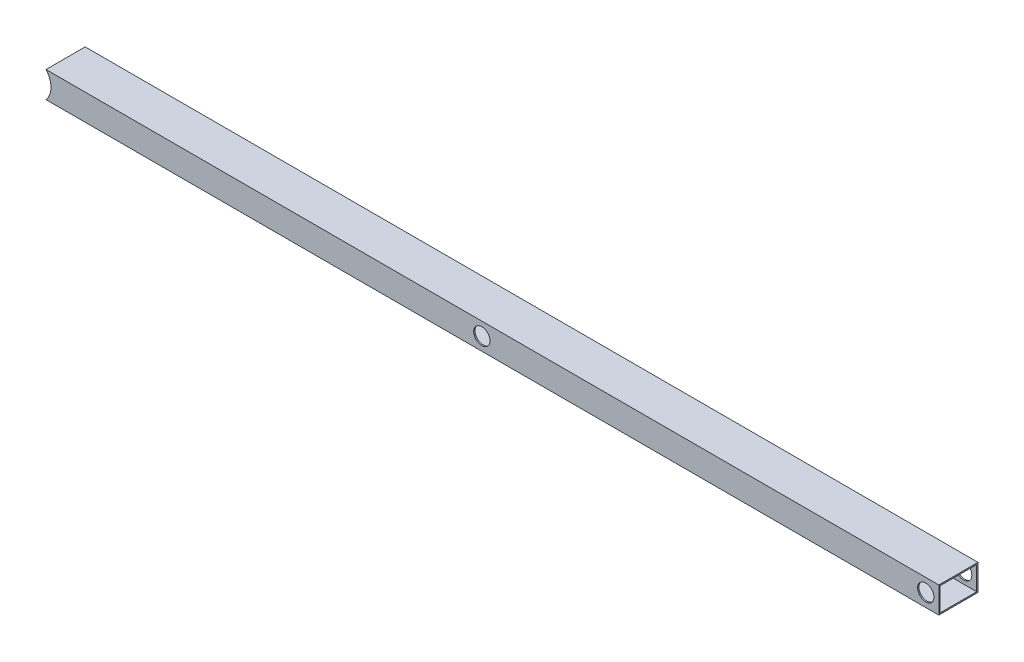
ISO-10303-21;
HEADER;
FILE_DESCRIPTION(('STEP AP214'),'2;1');
FILE_NAME('part.step','',(''),(''),'','','');
FILE_SCHEMA(('AUTOMOTIVE_DESIGN { 1 0 10303 214 1 1 1 1 }'));
ENDSEC;
DATA;
#1=APPLICATION_CONTEXT('core data for automotive mechanical design processes');
#2=APPLICATION_PROTOCOL_DEFINITION('international standard','automotive_design',2000,#1);
#3=PRODUCT_CONTEXT('',#1,'mechanical');
#4=PRODUCT('Part','Part','',(#3));
#5=PRODUCT_RELATED_PRODUCT_CATEGORY('part','',(#4));
#6=PRODUCT_DEFINITION_FORMATION('','',#4);
#7=PRODUCT_DEFINITION_CONTEXT('part definition',#1,'design');
#8=PRODUCT_DEFINITION('design','',#6,#7);
#9=PRODUCT_DEFINITION_SHAPE('','',#8);
#10=(LENGTH_UNIT() NAMED_UNIT(*) SI_UNIT(.MILLI.,.METRE.));
#11=(NAMED_UNIT(*) PLANE_ANGLE_UNIT() SI_UNIT($,.RADIAN.));
#12=(NAMED_UNIT(*) SI_UNIT($,.STERADIAN.) SOLID_ANGLE_UNIT());
#13=UNCERTAINTY_MEASURE_WITH_UNIT(LENGTH_MEASURE(1.E-05),#10,'distance_accuracy_value','');
#14=(GEOMETRIC_REPRESENTATION_CONTEXT(3) GLOBAL_UNCERTAINTY_ASSIGNED_CONTEXT((#13)) GLOBAL_UNIT_ASSIGNED_CONTEXT((#10,
#11,#12)) REPRESENTATION_CONTEXT('',''));
#15=CARTESIAN_POINT('',(0.,0.,0.));
#16=DIRECTION('',(0.,0.,1.));
#17=DIRECTION('',(1.,0.,0.));
#18=AXIS2_PLACEMENT_3D('',#15,#16,#17);
#19=CARTESIAN_POINT('',(680.,0.,30.));
#20=DIRECTION('',(0.,0.,-1.));
#21=DIRECTION('',(-1.,0.,0.));
#22=AXIS2_PLACEMENT_3D('',#19,#20,#21);
#23=CYLINDRICAL_SURFACE('',#22,12.5);
#24=CARTESIAN_POINT('',(680.,0.,28.));
#25=DIRECTION('',(0.,0.,1.));
#26=DIRECTION('',(1.,0.,0.));
#27=AXIS2_PLACEMENT_3D('',#24,#25,#26);
#28=CIRCLE('',#27,12.5);
#29=CARTESIAN_POINT('',(692.5,0.,28.));
#30=VERTEX_POINT('',#29);
#31=EDGE_CURVE('E155',#30,#30,#28,.T.);
#32=ORIENTED_EDGE('',*,*,#31,.F.);
#33=EDGE_LOOP('',(#32));
#34=FACE_BOUND('',#33,.T.);
#35=CARTESIAN_POINT('',(680.,0.,30.));
#36=DIRECTION('',(0.,0.,1.));
#37=DIRECTION('',(1.,0.,0.));
#38=AXIS2_PLACEMENT_3D('',#35,#36,#37);
#39=CIRCLE('',#38,12.5);
#40=CARTESIAN_POINT('',(692.5,0.,30.));
#41=VERTEX_POINT('',#40);
#42=EDGE_CURVE('E168',#41,#41,#39,.T.);
#43=ORIENTED_EDGE('',*,*,#42,.T.);
#44=EDGE_LOOP('',(#43));
#45=FACE_BOUND('',#44,.T.);
#46=ADVANCED_FACE('F44',(#34,#45),#23,.F.);
#47=CARTESIAN_POINT('',(0.,0.,30.));
#48=DIRECTION('',(0.,0.,-1.));
#49=DIRECTION('',(-1.,0.,0.));
#50=AXIS2_PLACEMENT_3D('',#47,#48,#49);
#51=CYLINDRICAL_SURFACE('',#50,12.5);
#52=CARTESIAN_POINT('',(0.,0.,28.));
#53=DIRECTION('',(0.,0.,1.));
#54=DIRECTION('',(1.,0.,0.));
#55=AXIS2_PLACEMENT_3D('',#52,#53,#54);
#56=CIRCLE('',#55,12.5);
#57=CARTESIAN_POINT('',(12.5,0.,28.));
#58=VERTEX_POINT('',#57);
#59=EDGE_CURVE('E48',#58,#58,#56,.T.);
#60=ORIENTED_EDGE('',*,*,#59,.F.);
#61=EDGE_LOOP('',(#60));
#62=FACE_BOUND('',#61,.T.);
#63=CARTESIAN_POINT('',(0.,0.,30.));
#64=DIRECTION('',(0.,0.,1.));
#65=DIRECTION('',(1.,0.,0.));
#66=AXIS2_PLACEMENT_3D('',#63,#64,#65);
#67=CIRCLE('',#66,12.5);
#68=CARTESIAN_POINT('',(12.5,0.,30.));
#69=VERTEX_POINT('',#68);
#70=EDGE_CURVE('E188',#69,#69,#67,.T.);
#71=ORIENTED_EDGE('',*,*,#70,.T.);
#72=EDGE_LOOP('',(#71));
#73=FACE_BOUND('',#72,.T.);
#74=ADVANCED_FACE('F231',(#62,#73),#51,.F.);
#75=CARTESIAN_POINT('',(-690.,0.,30.));
#76=DIRECTION('',(0.,0.,-1.));
#77=DIRECTION('',(-1.,0.,0.));
#78=AXIS2_PLACEMENT_3D('',#75,#76,#77);
#79=CYLINDRICAL_SURFACE('',#78,30.);
#80=DIRECTION('',(0.,0.,-1.));
#81=VECTOR('',#80,1.);
#82=CARTESIAN_POINT('',(-666.,-18.,30.));
#83=LINE('',#82,#81);
#84=CARTESIAN_POINT('',(-666.,-18.,-28.));
#85=VERTEX_POINT('',#84);
#86=CARTESIAN_POINT('',(-666.,-18.,28.));
#87=VERTEX_POINT('',#86);
#88=EDGE_CURVE('E164',#85,#87,#83,.F.);
#89=ORIENTED_EDGE('',*,*,#88,.F.);
#90=CARTESIAN_POINT('',(-690.,0.,-28.));
#91=DIRECTION('',(0.,0.,-1.));
#92=DIRECTION('',(-1.,0.,0.));
#93=AXIS2_PLACEMENT_3D('',#90,#91,#92);
#94=CIRCLE('',#93,30.);
#95=CARTESIAN_POINT('',(-666.,18.,-28.));
#96=VERTEX_POINT('',#95);
#97=EDGE_CURVE('E152',#96,#85,#94,.T.);
#98=ORIENTED_EDGE('',*,*,#97,.F.);
#99=DIRECTION('',(0.,0.,-1.));
#100=VECTOR('',#99,1.);
#101=CARTESIAN_POINT('',(-666.,18.,30.));
#102=LINE('',#101,#100);
#103=CARTESIAN_POINT('',(-666.,18.,28.));
#104=VERTEX_POINT('',#103);
#105=EDGE_CURVE('E117',#104,#96,#102,.T.);
#106=ORIENTED_EDGE('',*,*,#105,.F.);
#107=CARTESIAN_POINT('',(-690.,0.,28.));
#108=DIRECTION('',(0.,0.,1.));
#109=DIRECTION('',(1.,0.,0.));
#110=AXIS2_PLACEMENT_3D('',#107,#108,#109);
#111=CIRCLE('',#110,30.);
#112=EDGE_CURVE('E159',#87,#104,#111,.T.);
#113=ORIENTED_EDGE('',*,*,#112,.F.);
#114=EDGE_LOOP('',(#89,#98,#106,#113));
#115=FACE_BOUND('',#114,.T.);
#116=CARTESIAN_POINT('',(-690.,0.,-30.));
#117=DIRECTION('',(0.,0.,1.));
#118=DIRECTION('',(1.,0.,0.));
#119=AXIS2_PLACEMENT_3D('',#116,#117,#118);
#120=CIRCLE('',#119,30.);
#121=CARTESIAN_POINT('',(-667.639320225002,-19.9999999999998,-30.));
#122=VERTEX_POINT('',#121);
#123=CARTESIAN_POINT('',(-667.639320225002,19.9999999999999,-30.));
#124=VERTEX_POINT('',#123);
#125=EDGE_CURVE('E196',#122,#124,#120,.T.);
#126=ORIENTED_EDGE('',*,*,#125,.F.);
#127=DIRECTION('',(0.,0.,-1.));
#128=VECTOR('',#127,1.);
#129=CARTESIAN_POINT('',(-667.639320225002,-19.9999999999998,30.));
#130=LINE('',#129,#128);
#131=CARTESIAN_POINT('',(-667.639320225002,-19.9999999999998,30.));
#132=VERTEX_POINT('',#131);
#133=EDGE_CURVE('E11',#132,#122,#130,.T.);
#134=ORIENTED_EDGE('',*,*,#133,.F.);
#135=CARTESIAN_POINT('',(-690.,0.,30.));
#136=DIRECTION('',(0.,0.,1.));
#137=DIRECTION('',(1.,0.,0.));
#138=AXIS2_PLACEMENT_3D('',#135,#136,#137);
#139=CIRCLE('',#138,30.);
#140=CARTESIAN_POINT('',(-667.639320225002,19.9999999999999,30.));
#141=VERTEX_POINT('',#140);
#142=EDGE_CURVE('E172',#132,#141,#139,.T.);
#143=ORIENTED_EDGE('',*,*,#142,.T.);
#144=DIRECTION('',(0.,0.,-1.));
#145=VECTOR('',#144,1.);
#146=CARTESIAN_POINT('',(-667.639320225002,19.9999999999999,30.));
#147=LINE('',#146,#145);
#148=EDGE_CURVE('E192',#141,#124,#147,.T.);
#149=ORIENTED_EDGE('',*,*,#148,.T.);
#150=EDGE_LOOP('',(#126,#134,#143,#149));
#151=FACE_BOUND('',#150,.T.);
#152=ADVANCED_FACE('F254',(#115,#151),#79,.F.);
#153=CARTESIAN_POINT('',(0.,-19.9999999999999,30.));
#154=DIRECTION('',(0.,-1.,0.));
#155=DIRECTION('',(1.,0.,0.));
#156=AXIS2_PLACEMENT_3D('',#153,#154,#155);
#157=PLANE('',#156);
#158=DIRECTION('',(-1.,0.,0.));
#159=VECTOR('',#158,1.);
#160=CARTESIAN_POINT('',(0.,-19.9999999999999,-30.));
#161=LINE('',#160,#159);
#162=CARTESIAN_POINT('',(700.,-20.,-30.));
#163=VERTEX_POINT('',#162);
#164=EDGE_CURVE('E200',#163,#122,#161,.T.);
#165=ORIENTED_EDGE('',*,*,#164,.F.);
#166=DIRECTION('',(0.,0.,-1.));
#167=VECTOR('',#166,1.);
#168=CARTESIAN_POINT('',(700.,-20.,30.));
#169=LINE('',#168,#167);
#170=CARTESIAN_POINT('',(700.,-20.,30.));
#171=VERTEX_POINT('',#170);
#172=EDGE_CURVE('E54',#171,#163,#169,.T.);
#173=ORIENTED_EDGE('',*,*,#172,.F.);
#174=DIRECTION('',(-1.,0.,0.));
#175=VECTOR('',#174,1.);
#176=CARTESIAN_POINT('',(0.,-19.9999999999999,30.));
#177=LINE('',#176,#175);
#178=EDGE_CURVE('E177',#171,#132,#177,.T.);
#179=ORIENTED_EDGE('',*,*,#178,.T.);
#180=ORIENTED_EDGE('',*,*,#133,.T.);
#181=EDGE_LOOP('',(#165,#173,#179,#180));
#182=FACE_BOUND('',#181,.T.);
#183=ADVANCED_FACE('F296',(#182),#157,.T.);
#184=CARTESIAN_POINT('',(700.,0.,30.));
#185=DIRECTION('',(1.,0.,0.));
#186=DIRECTION('',(0.,0.,-1.));
#187=AXIS2_PLACEMENT_3D('',#184,#185,#186);
#188=PLANE('',#187);
#189=DIRECTION('',(0.,0.,-1.));
#190=VECTOR('',#189,1.);
#191=CARTESIAN_POINT('',(700.,-18.,28.));
#192=LINE('',#191,#190);
#193=CARTESIAN_POINT('',(700.,-18.,28.));
#194=VERTEX_POINT('',#193);
#195=CARTESIAN_POINT('',(700.,-18.,-28.));
#196=VERTEX_POINT('',#195);
#197=EDGE_CURVE('E70',#194,#196,#192,.T.);
#198=ORIENTED_EDGE('',*,*,#197,.F.);
#199=DIRECTION('',(0.,-1.,0.));
#200=VECTOR('',#199,1.);
#201=CARTESIAN_POINT('',(700.,18.,28.));
#202=LINE('',#201,#200);
#203=CARTESIAN_POINT('',(700.,18.,28.));
#204=VERTEX_POINT('',#203);
#205=EDGE_CURVE('E133',#204,#194,#202,.T.);
#206=ORIENTED_EDGE('',*,*,#205,.F.);
#207=DIRECTION('',(0.,0.,1.));
#208=VECTOR('',#207,1.);
#209=CARTESIAN_POINT('',(700.,18.,-28.));
#210=LINE('',#209,#208);
#211=CARTESIAN_POINT('',(700.,18.,-28.));
#212=VERTEX_POINT('',#211);
#213=EDGE_CURVE('E114',#212,#204,#210,.T.);
#214=ORIENTED_EDGE('',*,*,#213,.F.);
#215=DIRECTION('',(0.,1.,0.));
#216=VECTOR('',#215,1.);
#217=CARTESIAN_POINT('',(700.,-18.,-28.));
#218=LINE('',#217,#216);
#219=EDGE_CURVE('E124',#196,#212,#218,.T.);
#220=ORIENTED_EDGE('',*,*,#219,.F.);
#221=EDGE_LOOP('',(#198,#206,#214,#220));
#222=FACE_BOUND('',#221,.T.);
#223=DIRECTION('',(0.,-1.,0.));
#224=VECTOR('',#223,1.);
#225=CARTESIAN_POINT('',(700.,0.,-30.));
#226=LINE('',#225,#224);
#227=CARTESIAN_POINT('',(700.,20.,-30.));
#228=VERTEX_POINT('',#227);
#229=EDGE_CURVE('E204',#228,#163,#226,.T.);
#230=ORIENTED_EDGE('',*,*,#229,.F.);
#231=DIRECTION('',(0.,0.,-1.));
#232=VECTOR('',#231,1.);
#233=CARTESIAN_POINT('',(700.,20.,30.));
#234=LINE('',#233,#232);
#235=CARTESIAN_POINT('',(700.,20.,30.));
#236=VERTEX_POINT('',#235);
#237=EDGE_CURVE('E217',#236,#228,#234,.T.);
#238=ORIENTED_EDGE('',*,*,#237,.F.);
#239=DIRECTION('',(0.,-1.,0.));
#240=VECTOR('',#239,1.);
#241=CARTESIAN_POINT('',(700.,0.,30.));
#242=LINE('',#241,#240);
#243=EDGE_CURVE('E181',#236,#171,#242,.T.);
#244=ORIENTED_EDGE('',*,*,#243,.T.);
#245=ORIENTED_EDGE('',*,*,#172,.T.);
#246=EDGE_LOOP('',(#230,#238,#244,#245));
#247=FACE_BOUND('',#246,.T.);
#248=ADVANCED_FACE('F130',(#222,#247),#188,.T.);
#249=CARTESIAN_POINT('',(0.,19.9999999999999,30.));
#250=DIRECTION('',(0.,-1.,0.));
#251=DIRECTION('',(1.,0.,0.));
#252=AXIS2_PLACEMENT_3D('',#249,#250,#251);
#253=PLANE('',#252);
#254=DIRECTION('',(-1.,0.,0.));
#255=VECTOR('',#254,1.);
#256=CARTESIAN_POINT('',(0.,19.9999999999999,-30.));
#257=LINE('',#256,#255);
#258=EDGE_CURVE('E208',#228,#124,#257,.T.);
#259=ORIENTED_EDGE('',*,*,#258,.T.);
#260=ORIENTED_EDGE('',*,*,#148,.F.);
#261=DIRECTION('',(-1.,0.,0.));
#262=VECTOR('',#261,1.);
#263=CARTESIAN_POINT('',(0.,19.9999999999999,30.));
#264=LINE('',#263,#262);
#265=EDGE_CURVE('E185',#236,#141,#264,.T.);
#266=ORIENTED_EDGE('',*,*,#265,.F.);
#267=ORIENTED_EDGE('',*,*,#237,.T.);
#268=EDGE_LOOP('',(#259,#260,#266,#267));
#269=FACE_BOUND('',#268,.T.);
#270=ADVANCED_FACE('F259',(#269),#253,.F.);
#271=CARTESIAN_POINT('',(680.,0.,-28.));
#272=DIRECTION('',(0.,0.,-1.));
#273=DIRECTION('',(-1.,0.,0.));
#274=AXIS2_PLACEMENT_3D('',#271,#272,#273);
#275=CIRCLE('',#274,12.5);
#276=CARTESIAN_POINT('',(667.5,0.,-28.));
#277=VERTEX_POINT('',#276);
#278=EDGE_CURVE('E148',#277,#277,#275,.T.);
#279=ORIENTED_EDGE('',*,*,#278,.F.);
#280=EDGE_LOOP('',(#279));
#281=FACE_BOUND('',#280,.T.);
#282=CARTESIAN_POINT('',(680.,0.,-30.));
#283=DIRECTION('',(0.,0.,1.));
#284=DIRECTION('',(1.,0.,0.));
#285=AXIS2_PLACEMENT_3D('',#282,#283,#284);
#286=CIRCLE('',#285,12.5);
#287=CARTESIAN_POINT('',(692.5,0.,-30.));
#288=VERTEX_POINT('',#287);
#289=EDGE_CURVE('E167',#288,#288,#286,.T.);
#290=ORIENTED_EDGE('',*,*,#289,.F.);
#291=EDGE_LOOP('',(#290));
#292=FACE_BOUND('',#291,.T.);
#293=ADVANCED_FACE('F46',(#281,#292),#23,.F.);
#294=CARTESIAN_POINT('',(0.,0.,-28.));
#295=DIRECTION('',(0.,0.,-1.));
#296=DIRECTION('',(-1.,0.,0.));
#297=AXIS2_PLACEMENT_3D('',#294,#295,#296);
#298=CIRCLE('',#297,12.5);
#299=CARTESIAN_POINT('',(-12.5,0.,-28.));
#300=VERTEX_POINT('',#299);
#301=EDGE_CURVE('E143',#300,#300,#298,.T.);
#302=ORIENTED_EDGE('',*,*,#301,.F.);
#303=EDGE_LOOP('',(#302));
#304=FACE_BOUND('',#303,.T.);
#305=CARTESIAN_POINT('',(0.,0.,-30.));
#306=DIRECTION('',(0.,0.,1.));
#307=DIRECTION('',(1.,0.,0.));
#308=AXIS2_PLACEMENT_3D('',#305,#306,#307);
#309=CIRCLE('',#308,12.5);
#310=CARTESIAN_POINT('',(12.5,0.,-30.));
#311=VERTEX_POINT('',#310);
#312=EDGE_CURVE('E173',#311,#311,#309,.T.);
#313=ORIENTED_EDGE('',*,*,#312,.F.);
#314=EDGE_LOOP('',(#313));
#315=FACE_BOUND('',#314,.T.);
#316=ADVANCED_FACE('F226',(#304,#315),#51,.F.);
#317=CARTESIAN_POINT('',(0.,0.,30.));
#318=DIRECTION('',(0.,0.,1.));
#319=DIRECTION('',(1.,0.,0.));
#320=AXIS2_PLACEMENT_3D('',#317,#318,#319);
#321=PLANE('',#320);
#322=ORIENTED_EDGE('',*,*,#42,.F.);
#323=EDGE_LOOP('',(#322));
#324=FACE_BOUND('',#323,.T.);
#325=ORIENTED_EDGE('',*,*,#142,.F.);
#326=ORIENTED_EDGE('',*,*,#178,.F.);
#327=ORIENTED_EDGE('',*,*,#243,.F.);
#328=ORIENTED_EDGE('',*,*,#265,.T.);
#329=EDGE_LOOP('',(#325,#326,#327,#328));
#330=FACE_BOUND('',#329,.T.);
#331=ORIENTED_EDGE('',*,*,#70,.F.);
#332=EDGE_LOOP('',(#331));
#333=FACE_BOUND('',#332,.T.);
#334=ADVANCED_FACE('F229',(#324,#330,#333),#321,.T.);
#335=CARTESIAN_POINT('',(0.,0.,-30.));
#336=DIRECTION('',(0.,0.,1.));
#337=DIRECTION('',(1.,0.,0.));
#338=AXIS2_PLACEMENT_3D('',#335,#336,#337);
#339=PLANE('',#338);
#340=ORIENTED_EDGE('',*,*,#289,.T.);
#341=EDGE_LOOP('',(#340));
#342=FACE_BOUND('',#341,.T.);
#343=ORIENTED_EDGE('',*,*,#125,.T.);
#344=ORIENTED_EDGE('',*,*,#258,.F.);
#345=ORIENTED_EDGE('',*,*,#229,.T.);
#346=ORIENTED_EDGE('',*,*,#164,.T.);
#347=EDGE_LOOP('',(#343,#344,#345,#346));
#348=FACE_BOUND('',#347,.T.);
#349=ORIENTED_EDGE('',*,*,#312,.T.);
#350=EDGE_LOOP('',(#349));
#351=FACE_BOUND('',#350,.T.);
#352=ADVANCED_FACE('F234',(#342,#348,#351),#339,.F.);
#353=CARTESIAN_POINT('',(-667.639320225002,-18.,28.));
#354=DIRECTION('',(0.,-1.,0.));
#355=DIRECTION('',(0.,0.,-1.));
#356=AXIS2_PLACEMENT_3D('',#353,#354,#355);
#357=PLANE('',#356);
#358=ORIENTED_EDGE('',*,*,#88,.T.);
#359=DIRECTION('',(1.,0.,0.));
#360=VECTOR('',#359,1.);
#361=CARTESIAN_POINT('',(-667.639320225002,-18.,28.));
#362=LINE('',#361,#360);
#363=EDGE_CURVE('E140',#87,#194,#362,.T.);
#364=ORIENTED_EDGE('',*,*,#363,.T.);
#365=ORIENTED_EDGE('',*,*,#197,.T.);
#366=DIRECTION('',(1.,0.,0.));
#367=VECTOR('',#366,1.);
#368=CARTESIAN_POINT('',(-667.639320225002,-18.,-28.));
#369=LINE('',#368,#367);
#370=EDGE_CURVE('E121',#85,#196,#369,.T.);
#371=ORIENTED_EDGE('',*,*,#370,.F.);
#372=EDGE_LOOP('',(#358,#364,#365,#371));
#373=FACE_BOUND('',#372,.T.);
#374=ADVANCED_FACE('F236',(#373),#357,.F.);
#375=CARTESIAN_POINT('',(-667.639320225002,18.,28.));
#376=DIRECTION('',(0.,0.,1.));
#377=DIRECTION('',(1.,0.,0.));
#378=AXIS2_PLACEMENT_3D('',#375,#376,#377);
#379=PLANE('',#378);
#380=ORIENTED_EDGE('',*,*,#112,.T.);
#381=DIRECTION('',(1.,0.,0.));
#382=VECTOR('',#381,1.);
#383=CARTESIAN_POINT('',(-667.639320225002,18.,28.));
#384=LINE('',#383,#382);
#385=EDGE_CURVE('E120',#104,#204,#384,.T.);
#386=ORIENTED_EDGE('',*,*,#385,.T.);
#387=ORIENTED_EDGE('',*,*,#205,.T.);
#388=ORIENTED_EDGE('',*,*,#363,.F.);
#389=EDGE_LOOP('',(#380,#386,#387,#388));
#390=FACE_BOUND('',#389,.T.);
#391=ORIENTED_EDGE('',*,*,#31,.T.);
#392=EDGE_LOOP('',(#391));
#393=FACE_BOUND('',#392,.T.);
#394=ORIENTED_EDGE('',*,*,#59,.T.);
#395=EDGE_LOOP('',(#394));
#396=FACE_BOUND('',#395,.T.);
#397=ADVANCED_FACE('F244',(#390,#393,#396),#379,.F.);
#398=CARTESIAN_POINT('',(-667.639320225002,18.,-28.));
#399=DIRECTION('',(0.,1.,0.));
#400=DIRECTION('',(0.,0.,1.));
#401=AXIS2_PLACEMENT_3D('',#398,#399,#400);
#402=PLANE('',#401);
#403=ORIENTED_EDGE('',*,*,#105,.T.);
#404=DIRECTION('',(1.,0.,0.));
#405=VECTOR('',#404,1.);
#406=CARTESIAN_POINT('',(-667.639320225002,18.,-28.));
#407=LINE('',#406,#405);
#408=EDGE_CURVE('E62',#96,#212,#407,.T.);
#409=ORIENTED_EDGE('',*,*,#408,.T.);
#410=ORIENTED_EDGE('',*,*,#213,.T.);
#411=ORIENTED_EDGE('',*,*,#385,.F.);
#412=EDGE_LOOP('',(#403,#409,#410,#411));
#413=FACE_BOUND('',#412,.T.);
#414=ADVANCED_FACE('F111',(#413),#402,.F.);
#415=CARTESIAN_POINT('',(-667.639320225002,-18.,-28.));
#416=DIRECTION('',(0.,0.,-1.));
#417=DIRECTION('',(-1.,0.,0.));
#418=AXIS2_PLACEMENT_3D('',#415,#416,#417);
#419=PLANE('',#418);
#420=ORIENTED_EDGE('',*,*,#97,.T.);
#421=ORIENTED_EDGE('',*,*,#370,.T.);
#422=ORIENTED_EDGE('',*,*,#219,.T.);
#423=ORIENTED_EDGE('',*,*,#408,.F.);
#424=EDGE_LOOP('',(#420,#421,#422,#423));
#425=FACE_BOUND('',#424,.T.);
#426=ORIENTED_EDGE('',*,*,#278,.T.);
#427=EDGE_LOOP('',(#426));
#428=FACE_BOUND('',#427,.T.);
#429=ORIENTED_EDGE('',*,*,#301,.T.);
#430=EDGE_LOOP('',(#429));
#431=FACE_BOUND('',#430,.T.);
#432=ADVANCED_FACE('F125',(#425,#428,#431),#419,.F.);
#433=CLOSED_SHELL('',(#46,#74,#152,#183,#248,#270,#293,#316,#334,#352,#374,#397,#414,#432));
#434=MANIFOLD_SOLID_BREP('B2',#433);
#435=ADVANCED_BREP_SHAPE_REPRESENTATION('',(#18,#434),#14);
#436=SHAPE_DEFINITION_REPRESENTATION(#9,#435);
ENDSEC;
END-ISO-10303-21;
